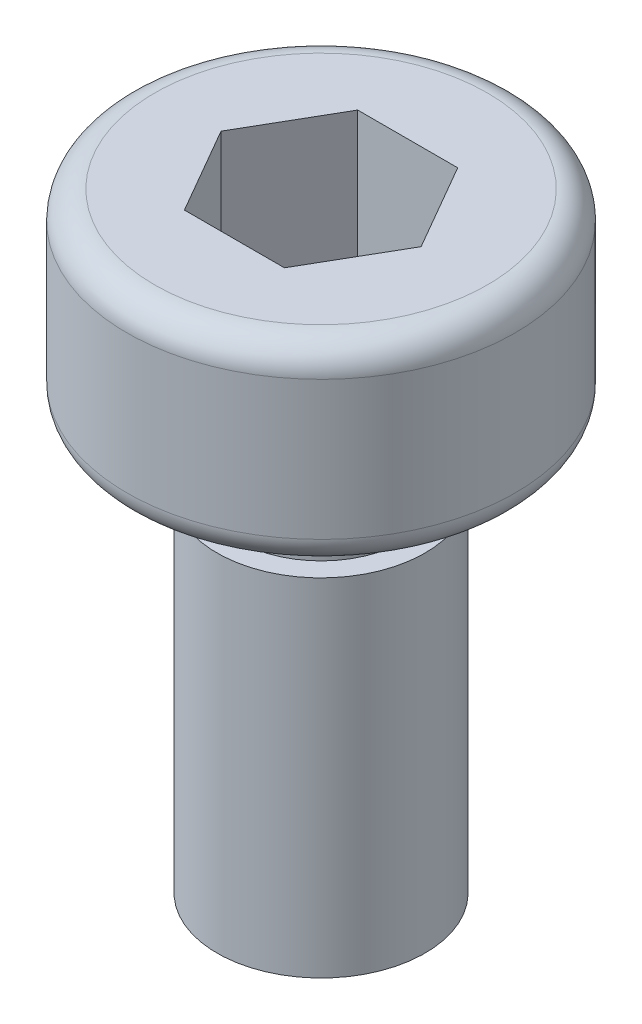
ISO-10303-21;
HEADER;
FILE_DESCRIPTION(('STEP AP214'),'2;1');
FILE_NAME('part.step','',(''),(''),'','','');
FILE_SCHEMA(('AUTOMOTIVE_DESIGN { 1 0 10303 214 1 1 1 1 }'));
ENDSEC;
DATA;
#1=APPLICATION_CONTEXT('core data for automotive mechanical design processes');
#2=APPLICATION_PROTOCOL_DEFINITION('international standard','automotive_design',2000,#1);
#3=PRODUCT_CONTEXT('',#1,'mechanical');
#4=PRODUCT('Part','Part','',(#3));
#5=PRODUCT_RELATED_PRODUCT_CATEGORY('part','',(#4));
#6=PRODUCT_DEFINITION_FORMATION('','',#4);
#7=PRODUCT_DEFINITION_CONTEXT('part definition',#1,'design');
#8=PRODUCT_DEFINITION('design','',#6,#7);
#9=PRODUCT_DEFINITION_SHAPE('','',#8);
#10=(LENGTH_UNIT() NAMED_UNIT(*) SI_UNIT(.MILLI.,.METRE.));
#11=(NAMED_UNIT(*) PLANE_ANGLE_UNIT() SI_UNIT($,.RADIAN.));
#12=(NAMED_UNIT(*) SI_UNIT($,.STERADIAN.) SOLID_ANGLE_UNIT());
#13=UNCERTAINTY_MEASURE_WITH_UNIT(LENGTH_MEASURE(1.E-05),#10,'distance_accuracy_value','');
#14=(GEOMETRIC_REPRESENTATION_CONTEXT(3) GLOBAL_UNCERTAINTY_ASSIGNED_CONTEXT((#13)) GLOBAL_UNIT_ASSIGNED_CONTEXT((#10,
#11,#12)) REPRESENTATION_CONTEXT('',''));
#15=CARTESIAN_POINT('',(0.,0.,0.));
#16=DIRECTION('',(0.,0.,1.));
#17=DIRECTION('',(1.,0.,0.));
#18=AXIS2_PLACEMENT_3D('',#15,#16,#17);
#19=CARTESIAN_POINT('',(0.,8.8,0.));
#20=DIRECTION('',(0.,-1.,0.));
#21=DIRECTION('',(0.,0.,-1.));
#22=AXIS2_PLACEMENT_3D('',#19,#20,#21);
#23=PLANE('',#22);
#24=DIRECTION('',(-0.5,0.,0.866025403784439));
#25=VECTOR('',#24,1.);
#26=CARTESIAN_POINT('',(-0.721687836487032,8.8,-1.25));
#27=LINE('',#26,#25);
#28=CARTESIAN_POINT('',(-0.721687836487032,8.8,-1.25));
#29=VERTEX_POINT('',#28);
#30=CARTESIAN_POINT('',(-1.44337567297406,8.8,0.));
#31=VERTEX_POINT('',#30);
#32=EDGE_CURVE('E124',#29,#31,#27,.T.);
#33=ORIENTED_EDGE('',*,*,#32,.F.);
#34=DIRECTION('',(-1.,0.,0.));
#35=VECTOR('',#34,1.);
#36=CARTESIAN_POINT('',(0.721687836487033,8.8,-1.25));
#37=LINE('',#36,#35);
#38=CARTESIAN_POINT('',(0.721687836487033,8.8,-1.25));
#39=VERTEX_POINT('',#38);
#40=EDGE_CURVE('E50',#39,#29,#37,.T.);
#41=ORIENTED_EDGE('',*,*,#40,.F.);
#42=DIRECTION('',(-0.5,0.,-0.866025403784439));
#43=VECTOR('',#42,1.);
#44=CARTESIAN_POINT('',(1.44337567297406,8.8,0.));
#45=LINE('',#44,#43);
#46=CARTESIAN_POINT('',(1.44337567297406,8.8,0.));
#47=VERTEX_POINT('',#46);
#48=EDGE_CURVE('E133',#47,#39,#45,.T.);
#49=ORIENTED_EDGE('',*,*,#48,.F.);
#50=DIRECTION('',(0.5,0.,-0.866025403784439));
#51=VECTOR('',#50,1.);
#52=CARTESIAN_POINT('',(0.721687836487032,8.8,1.25));
#53=LINE('',#52,#51);
#54=CARTESIAN_POINT('',(0.721687836487032,8.8,1.25));
#55=VERTEX_POINT('',#54);
#56=EDGE_CURVE('E131',#55,#47,#53,.T.);
#57=ORIENTED_EDGE('',*,*,#56,.F.);
#58=DIRECTION('',(1.,0.,0.));
#59=VECTOR('',#58,1.);
#60=CARTESIAN_POINT('',(-0.721687836487033,8.8,1.25));
#61=LINE('',#60,#59);
#62=CARTESIAN_POINT('',(-0.721687836487033,8.8,1.25));
#63=VERTEX_POINT('',#62);
#64=EDGE_CURVE('E98',#63,#55,#61,.T.);
#65=ORIENTED_EDGE('',*,*,#64,.F.);
#66=DIRECTION('',(0.5,0.,0.866025403784439));
#67=VECTOR('',#66,1.);
#68=CARTESIAN_POINT('',(-1.44337567297406,8.8,0.));
#69=LINE('',#68,#67);
#70=EDGE_CURVE('E127',#31,#63,#69,.T.);
#71=ORIENTED_EDGE('',*,*,#70,.F.);
#72=EDGE_LOOP('',(#33,#41,#49,#57,#65,#71));
#73=FACE_BOUND('',#72,.T.);
#74=CARTESIAN_POINT('',(0.,8.8,0.));
#75=DIRECTION('',(0.,-1.,0.));
#76=DIRECTION('',(0.,0.,-1.));
#77=AXIS2_PLACEMENT_3D('',#74,#75,#76);
#78=CIRCLE('',#77,2.4);
#79=CARTESIAN_POINT('',(0.,8.8,-2.4));
#80=VERTEX_POINT('',#79);
#81=EDGE_CURVE('E11',#80,#80,#78,.T.);
#82=ORIENTED_EDGE('',*,*,#81,.F.);
#83=EDGE_LOOP('',(#82));
#84=FACE_BOUND('',#83,.T.);
#85=ADVANCED_FACE('F36',(#73,#84),#23,.F.);
#86=CARTESIAN_POINT('',(0.,8.4,0.));
#87=DIRECTION('',(0.,-1.,0.));
#88=DIRECTION('',(0.,0.,-1.));
#89=AXIS2_PLACEMENT_3D('',#86,#87,#88);
#90=TOROIDAL_SURFACE('',#89,2.4,0.399999999999999);
#91=CARTESIAN_POINT('',(0.,8.4,0.));
#92=DIRECTION('',(0.,-1.,0.));
#93=DIRECTION('',(0.,0.,-1.));
#94=AXIS2_PLACEMENT_3D('',#91,#92,#93);
#95=CIRCLE('',#94,2.8);
#96=CARTESIAN_POINT('',(0.,8.4,-2.8));
#97=VERTEX_POINT('',#96);
#98=EDGE_CURVE('E43',#97,#97,#95,.T.);
#99=ORIENTED_EDGE('',*,*,#98,.F.);
#100=EDGE_LOOP('',(#99));
#101=FACE_BOUND('',#100,.T.);
#102=ORIENTED_EDGE('',*,*,#81,.T.);
#103=EDGE_LOOP('',(#102));
#104=FACE_BOUND('',#103,.T.);
#105=ADVANCED_FACE('F164',(#101,#104),#90,.T.);
#106=CARTESIAN_POINT('',(0.,0.,0.));
#107=DIRECTION('',(0.,-1.,0.));
#108=DIRECTION('',(0.,0.,-1.));
#109=AXIS2_PLACEMENT_3D('',#106,#107,#108);
#110=CYLINDRICAL_SURFACE('',#109,2.8);
#111=CARTESIAN_POINT('',(0.,6.4,0.));
#112=DIRECTION('',(0.,-1.,0.));
#113=DIRECTION('',(0.,0.,-1.));
#114=AXIS2_PLACEMENT_3D('',#111,#112,#113);
#115=CIRCLE('',#114,2.8);
#116=CARTESIAN_POINT('',(0.,6.4,-2.8));
#117=VERTEX_POINT('',#116);
#118=EDGE_CURVE('E157',#117,#117,#115,.T.);
#119=ORIENTED_EDGE('',*,*,#118,.F.);
#120=EDGE_LOOP('',(#119));
#121=FACE_BOUND('',#120,.T.);
#122=ORIENTED_EDGE('',*,*,#98,.T.);
#123=EDGE_LOOP('',(#122));
#124=FACE_BOUND('',#123,.T.);
#125=ADVANCED_FACE('F162',(#121,#124),#110,.T.);
#126=CARTESIAN_POINT('',(0.,6.4,0.));
#127=DIRECTION('',(0.,-1.,0.));
#128=DIRECTION('',(0.,0.,-1.));
#129=AXIS2_PLACEMENT_3D('',#126,#127,#128);
#130=TOROIDAL_SURFACE('',#129,2.4,0.4);
#131=CARTESIAN_POINT('',(0.,6.,0.));
#132=DIRECTION('',(0.,-1.,0.));
#133=DIRECTION('',(0.,0.,-1.));
#134=AXIS2_PLACEMENT_3D('',#131,#132,#133);
#135=CIRCLE('',#134,2.4);
#136=CARTESIAN_POINT('',(0.,6.,-2.4));
#137=VERTEX_POINT('',#136);
#138=EDGE_CURVE('E154',#137,#137,#135,.T.);
#139=ORIENTED_EDGE('',*,*,#138,.F.);
#140=EDGE_LOOP('',(#139));
#141=FACE_BOUND('',#140,.T.);
#142=ORIENTED_EDGE('',*,*,#118,.T.);
#143=EDGE_LOOP('',(#142));
#144=FACE_BOUND('',#143,.T.);
#145=ADVANCED_FACE('F209',(#141,#144),#130,.T.);
#146=CARTESIAN_POINT('',(-2.4,6.,0.));
#147=DIRECTION('',(0.,1.,0.));
#148=DIRECTION('',(0.,0.,1.));
#149=AXIS2_PLACEMENT_3D('',#146,#147,#148);
#150=PLANE('',#149);
#151=CARTESIAN_POINT('',(0.,6.,0.));
#152=DIRECTION('',(0.,-1.,0.));
#153=DIRECTION('',(0.,0.,-1.));
#154=AXIS2_PLACEMENT_3D('',#151,#152,#153);
#155=CIRCLE('',#154,1.2);
#156=CARTESIAN_POINT('',(0.,6.,-1.2));
#157=VERTEX_POINT('',#156);
#158=EDGE_CURVE('E151',#157,#157,#155,.T.);
#159=ORIENTED_EDGE('',*,*,#158,.F.);
#160=EDGE_LOOP('',(#159));
#161=FACE_BOUND('',#160,.T.);
#162=ORIENTED_EDGE('',*,*,#138,.T.);
#163=EDGE_LOOP('',(#162));
#164=FACE_BOUND('',#163,.T.);
#165=ADVANCED_FACE('F205',(#161,#164),#150,.F.);
#166=CARTESIAN_POINT('',(0.,0.,0.));
#167=DIRECTION('',(0.,-1.,0.));
#168=DIRECTION('',(0.,0.,-1.));
#169=AXIS2_PLACEMENT_3D('',#166,#167,#168);
#170=CYLINDRICAL_SURFACE('',#169,1.2);
#171=CARTESIAN_POINT('',(0.,5.,0.));
#172=DIRECTION('',(0.,-1.,0.));
#173=DIRECTION('',(0.,0.,-1.));
#174=AXIS2_PLACEMENT_3D('',#171,#172,#173);
#175=CIRCLE('',#174,1.2);
#176=CARTESIAN_POINT('',(0.,5.,-1.2));
#177=VERTEX_POINT('',#176);
#178=EDGE_CURVE('E148',#177,#177,#175,.T.);
#179=ORIENTED_EDGE('',*,*,#178,.F.);
#180=EDGE_LOOP('',(#179));
#181=FACE_BOUND('',#180,.T.);
#182=ORIENTED_EDGE('',*,*,#158,.T.);
#183=EDGE_LOOP('',(#182));
#184=FACE_BOUND('',#183,.T.);
#185=ADVANCED_FACE('F201',(#181,#184),#170,.T.);
#186=CARTESIAN_POINT('',(-1.2,5.,0.));
#187=DIRECTION('',(0.,-1.,0.));
#188=DIRECTION('',(0.,0.,-1.));
#189=AXIS2_PLACEMENT_3D('',#186,#187,#188);
#190=PLANE('',#189);
#191=CARTESIAN_POINT('',(0.,5.,0.));
#192=DIRECTION('',(0.,-1.,0.));
#193=DIRECTION('',(0.,0.,-1.));
#194=AXIS2_PLACEMENT_3D('',#191,#192,#193);
#195=CIRCLE('',#194,1.5);
#196=CARTESIAN_POINT('',(0.,5.,-1.5));
#197=VERTEX_POINT('',#196);
#198=EDGE_CURVE('E145',#197,#197,#195,.T.);
#199=ORIENTED_EDGE('',*,*,#198,.F.);
#200=EDGE_LOOP('',(#199));
#201=FACE_BOUND('',#200,.T.);
#202=ORIENTED_EDGE('',*,*,#178,.T.);
#203=EDGE_LOOP('',(#202));
#204=FACE_BOUND('',#203,.T.);
#205=ADVANCED_FACE('F197',(#201,#204),#190,.F.);
#206=CARTESIAN_POINT('',(0.,0.,0.));
#207=DIRECTION('',(0.,-1.,0.));
#208=DIRECTION('',(0.,0.,-1.));
#209=AXIS2_PLACEMENT_3D('',#206,#207,#208);
#210=CYLINDRICAL_SURFACE('',#209,1.5);
#211=CARTESIAN_POINT('',(0.,0.,0.));
#212=DIRECTION('',(0.,-1.,0.));
#213=DIRECTION('',(0.,0.,-1.));
#214=AXIS2_PLACEMENT_3D('',#211,#212,#213);
#215=CIRCLE('',#214,1.5);
#216=CARTESIAN_POINT('',(0.,0.,-1.5));
#217=VERTEX_POINT('',#216);
#218=EDGE_CURVE('E137',#217,#217,#215,.T.);
#219=ORIENTED_EDGE('',*,*,#218,.F.);
#220=EDGE_LOOP('',(#219));
#221=FACE_BOUND('',#220,.T.);
#222=ORIENTED_EDGE('',*,*,#198,.T.);
#223=EDGE_LOOP('',(#222));
#224=FACE_BOUND('',#223,.T.);
#225=ADVANCED_FACE('F189',(#221,#224),#210,.T.);
#226=CARTESIAN_POINT('',(-1.5,0.,0.));
#227=DIRECTION('',(0.,1.,0.));
#228=DIRECTION('',(0.,0.,1.));
#229=AXIS2_PLACEMENT_3D('',#226,#227,#228);
#230=PLANE('',#229);
#231=ORIENTED_EDGE('',*,*,#218,.T.);
#232=EDGE_LOOP('',(#231));
#233=FACE_BOUND('',#232,.T.);
#234=ADVANCED_FACE('F182',(#233),#230,.F.);
#235=CARTESIAN_POINT('',(0.721687836487033,6.8,-1.25));
#236=DIRECTION('',(0.,0.,-1.));
#237=DIRECTION('',(-1.,0.,0.));
#238=AXIS2_PLACEMENT_3D('',#235,#236,#237);
#239=PLANE('',#238);
#240=ORIENTED_EDGE('',*,*,#40,.T.);
#241=DIRECTION('',(0.,1.,0.));
#242=VECTOR('',#241,1.);
#243=CARTESIAN_POINT('',(-0.721687836487032,6.8,-1.25));
#244=LINE('',#243,#242);
#245=CARTESIAN_POINT('',(-0.721687836487032,6.8,-1.25));
#246=VERTEX_POINT('',#245);
#247=EDGE_CURVE('E80',#246,#29,#244,.T.);
#248=ORIENTED_EDGE('',*,*,#247,.F.);
#249=DIRECTION('',(-1.,0.,0.));
#250=VECTOR('',#249,1.);
#251=CARTESIAN_POINT('',(0.721687836487033,6.8,-1.25));
#252=LINE('',#251,#250);
#253=CARTESIAN_POINT('',(0.721687836487033,6.8,-1.25));
#254=VERTEX_POINT('',#253);
#255=EDGE_CURVE('E135',#254,#246,#252,.T.);
#256=ORIENTED_EDGE('',*,*,#255,.F.);
#257=DIRECTION('',(0.,1.,0.));
#258=VECTOR('',#257,1.);
#259=CARTESIAN_POINT('',(0.721687836487033,6.8,-1.25));
#260=LINE('',#259,#258);
#261=EDGE_CURVE('E58',#254,#39,#260,.T.);
#262=ORIENTED_EDGE('',*,*,#261,.T.);
#263=EDGE_LOOP('',(#240,#248,#256,#262));
#264=FACE_BOUND('',#263,.T.);
#265=ADVANCED_FACE('F179',(#264),#239,.F.);
#266=CARTESIAN_POINT('',(1.44337567297406,6.8,0.));
#267=DIRECTION('',(0.866025403784439,0.,-0.5));
#268=DIRECTION('',(-0.5,0.,-0.866025403784439));
#269=AXIS2_PLACEMENT_3D('',#266,#267,#268);
#270=PLANE('',#269);
#271=ORIENTED_EDGE('',*,*,#48,.T.);
#272=ORIENTED_EDGE('',*,*,#261,.F.);
#273=DIRECTION('',(-0.5,0.,-0.866025403784439));
#274=VECTOR('',#273,1.);
#275=CARTESIAN_POINT('',(1.44337567297406,6.8,0.));
#276=LINE('',#275,#274);
#277=CARTESIAN_POINT('',(1.44337567297406,6.8,0.));
#278=VERTEX_POINT('',#277);
#279=EDGE_CURVE('E110',#278,#254,#276,.T.);
#280=ORIENTED_EDGE('',*,*,#279,.F.);
#281=DIRECTION('',(0.,1.,0.));
#282=VECTOR('',#281,1.);
#283=CARTESIAN_POINT('',(1.44337567297406,6.8,0.));
#284=LINE('',#283,#282);
#285=EDGE_CURVE('E102',#278,#47,#284,.T.);
#286=ORIENTED_EDGE('',*,*,#285,.T.);
#287=EDGE_LOOP('',(#271,#272,#280,#286));
#288=FACE_BOUND('',#287,.T.);
#289=ADVANCED_FACE('F181',(#288),#270,.F.);
#290=CARTESIAN_POINT('',(0.721687836487032,6.8,1.25));
#291=DIRECTION('',(0.866025403784439,0.,0.5));
#292=DIRECTION('',(0.5,0.,-0.866025403784439));
#293=AXIS2_PLACEMENT_3D('',#290,#291,#292);
#294=PLANE('',#293);
#295=ORIENTED_EDGE('',*,*,#56,.T.);
#296=ORIENTED_EDGE('',*,*,#285,.F.);
#297=DIRECTION('',(0.5,0.,-0.866025403784439));
#298=VECTOR('',#297,1.);
#299=CARTESIAN_POINT('',(0.721687836487032,6.8,1.25));
#300=LINE('',#299,#298);
#301=CARTESIAN_POINT('',(0.721687836487032,6.8,1.25));
#302=VERTEX_POINT('',#301);
#303=EDGE_CURVE('E106',#302,#278,#300,.T.);
#304=ORIENTED_EDGE('',*,*,#303,.F.);
#305=DIRECTION('',(0.,1.,0.));
#306=VECTOR('',#305,1.);
#307=CARTESIAN_POINT('',(0.721687836487032,6.8,1.25));
#308=LINE('',#307,#306);
#309=EDGE_CURVE('E91',#302,#55,#308,.T.);
#310=ORIENTED_EDGE('',*,*,#309,.T.);
#311=EDGE_LOOP('',(#295,#296,#304,#310));
#312=FACE_BOUND('',#311,.T.);
#313=ADVANCED_FACE('F107',(#312),#294,.F.);
#314=CARTESIAN_POINT('',(-0.721687836487033,6.8,1.25));
#315=DIRECTION('',(0.,0.,1.));
#316=DIRECTION('',(1.,0.,0.));
#317=AXIS2_PLACEMENT_3D('',#314,#315,#316);
#318=PLANE('',#317);
#319=ORIENTED_EDGE('',*,*,#64,.T.);
#320=ORIENTED_EDGE('',*,*,#309,.F.);
#321=DIRECTION('',(1.,0.,0.));
#322=VECTOR('',#321,1.);
#323=CARTESIAN_POINT('',(-0.721687836487033,6.8,1.25));
#324=LINE('',#323,#322);
#325=CARTESIAN_POINT('',(-0.721687836487033,6.8,1.25));
#326=VERTEX_POINT('',#325);
#327=EDGE_CURVE('E95',#326,#302,#324,.T.);
#328=ORIENTED_EDGE('',*,*,#327,.F.);
#329=DIRECTION('',(0.,1.,0.));
#330=VECTOR('',#329,1.);
#331=CARTESIAN_POINT('',(-0.721687836487033,6.8,1.25));
#332=LINE('',#331,#330);
#333=EDGE_CURVE('E103',#326,#63,#332,.T.);
#334=ORIENTED_EDGE('',*,*,#333,.T.);
#335=EDGE_LOOP('',(#319,#320,#328,#334));
#336=FACE_BOUND('',#335,.T.);
#337=ADVANCED_FACE('F93',(#336),#318,.F.);
#338=CARTESIAN_POINT('',(-1.44337567297406,6.8,0.));
#339=DIRECTION('',(-0.866025403784439,0.,0.5));
#340=DIRECTION('',(0.5,0.,0.866025403784439));
#341=AXIS2_PLACEMENT_3D('',#338,#339,#340);
#342=PLANE('',#341);
#343=ORIENTED_EDGE('',*,*,#70,.T.);
#344=ORIENTED_EDGE('',*,*,#333,.F.);
#345=DIRECTION('',(0.5,0.,0.866025403784439));
#346=VECTOR('',#345,1.);
#347=CARTESIAN_POINT('',(-1.44337567297406,6.8,0.));
#348=LINE('',#347,#346);
#349=CARTESIAN_POINT('',(-1.44337567297406,6.8,0.));
#350=VERTEX_POINT('',#349);
#351=EDGE_CURVE('E116',#350,#326,#348,.T.);
#352=ORIENTED_EDGE('',*,*,#351,.F.);
#353=DIRECTION('',(0.,1.,0.));
#354=VECTOR('',#353,1.);
#355=CARTESIAN_POINT('',(-1.44337567297406,6.8,0.));
#356=LINE('',#355,#354);
#357=EDGE_CURVE('E140',#350,#31,#356,.T.);
#358=ORIENTED_EDGE('',*,*,#357,.T.);
#359=EDGE_LOOP('',(#343,#344,#352,#358));
#360=FACE_BOUND('',#359,.T.);
#361=ADVANCED_FACE('F280',(#360),#342,.F.);
#362=CARTESIAN_POINT('',(-0.721687836487032,6.8,-1.25));
#363=DIRECTION('',(-0.866025403784439,0.,-0.5));
#364=DIRECTION('',(-0.5,0.,0.866025403784439));
#365=AXIS2_PLACEMENT_3D('',#362,#363,#364);
#366=PLANE('',#365);
#367=ORIENTED_EDGE('',*,*,#32,.T.);
#368=ORIENTED_EDGE('',*,*,#357,.F.);
#369=DIRECTION('',(-0.5,0.,0.866025403784439));
#370=VECTOR('',#369,1.);
#371=CARTESIAN_POINT('',(-0.721687836487032,6.8,-1.25));
#372=LINE('',#371,#370);
#373=EDGE_CURVE('E118',#246,#350,#372,.T.);
#374=ORIENTED_EDGE('',*,*,#373,.F.);
#375=ORIENTED_EDGE('',*,*,#247,.T.);
#376=EDGE_LOOP('',(#367,#368,#374,#375));
#377=FACE_BOUND('',#376,.T.);
#378=ADVANCED_FACE('F177',(#377),#366,.F.);
#379=CARTESIAN_POINT('',(0.,6.8,0.));
#380=DIRECTION('',(0.,1.,0.));
#381=DIRECTION('',(0.,0.,1.));
#382=AXIS2_PLACEMENT_3D('',#379,#380,#381);
#383=PLANE('',#382);
#384=ORIENTED_EDGE('',*,*,#255,.T.);
#385=ORIENTED_EDGE('',*,*,#373,.T.);
#386=ORIENTED_EDGE('',*,*,#351,.T.);
#387=ORIENTED_EDGE('',*,*,#327,.T.);
#388=ORIENTED_EDGE('',*,*,#303,.T.);
#389=ORIENTED_EDGE('',*,*,#279,.T.);
#390=EDGE_LOOP('',(#384,#385,#386,#387,#388,#389));
#391=FACE_BOUND('',#390,.T.);
#392=ADVANCED_FACE('F113',(#391),#383,.T.);
#393=CLOSED_SHELL('',(#85,#105,#125,#145,#165,#185,#205,#225,#234,#265,#289,#313,#337,#361,#378,#392));
#394=MANIFOLD_SOLID_BREP('B2',#393);
#395=ADVANCED_BREP_SHAPE_REPRESENTATION('',(#18,#394),#14);
#396=SHAPE_DEFINITION_REPRESENTATION(#9,#395);
ENDSEC;
END-ISO-10303-21;
